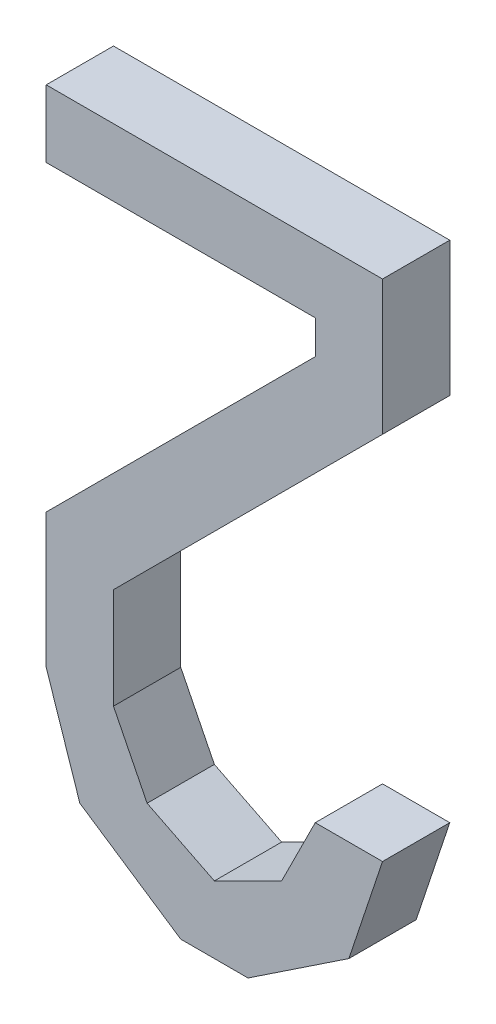
ISO-10303-21;
HEADER;
FILE_DESCRIPTION(('STEP AP214'),'2;1');
FILE_NAME('part.step','',(''),(''),'','','');
FILE_SCHEMA(('AUTOMOTIVE_DESIGN { 1 0 10303 214 1 1 1 1 }'));
ENDSEC;
DATA;
#1=APPLICATION_CONTEXT('core data for automotive mechanical design processes');
#2=APPLICATION_PROTOCOL_DEFINITION('international standard','automotive_design',2000,#1);
#3=PRODUCT_CONTEXT('',#1,'mechanical');
#4=PRODUCT('Part','Part','',(#3));
#5=PRODUCT_RELATED_PRODUCT_CATEGORY('part','',(#4));
#6=PRODUCT_DEFINITION_FORMATION('','',#4);
#7=PRODUCT_DEFINITION_CONTEXT('part definition',#1,'design');
#8=PRODUCT_DEFINITION('design','',#6,#7);
#9=PRODUCT_DEFINITION_SHAPE('','',#8);
#10=(LENGTH_UNIT() NAMED_UNIT(*) SI_UNIT(.MILLI.,.METRE.));
#11=(NAMED_UNIT(*) PLANE_ANGLE_UNIT() SI_UNIT($,.RADIAN.));
#12=(NAMED_UNIT(*) SI_UNIT($,.STERADIAN.) SOLID_ANGLE_UNIT());
#13=UNCERTAINTY_MEASURE_WITH_UNIT(LENGTH_MEASURE(1.E-05),#10,'distance_accuracy_value','');
#14=(GEOMETRIC_REPRESENTATION_CONTEXT(3) GLOBAL_UNCERTAINTY_ASSIGNED_CONTEXT((#13)) GLOBAL_UNIT_ASSIGNED_CONTEXT((#10,
#11,#12)) REPRESENTATION_CONTEXT('',''));
#15=CARTESIAN_POINT('',(0.,0.,0.));
#16=DIRECTION('',(0.,0.,1.));
#17=DIRECTION('',(1.,0.,0.));
#18=AXIS2_PLACEMENT_3D('',#15,#16,#17);
#19=CARTESIAN_POINT('',(0.0635,0.127,0.0254));
#20=DIRECTION('',(0.,0.,1.));
#21=DIRECTION('',(1.,0.,0.));
#22=AXIS2_PLACEMENT_3D('',#19,#20,#21);
#23=PLANE('',#22);
#24=DIRECTION('',(0.707106781186048,0.707106781187048,0.));
#25=VECTOR('',#24,1.);
#26=CARTESIAN_POINT('',(0.0635,0.0762,0.0254));
#27=LINE('',#26,#25);
#28=CARTESIAN_POINT('',(0.0635,0.0762,0.0254));
#29=VERTEX_POINT('',#28);
#30=CARTESIAN_POINT('',(-0.0380999999999845,-0.0254000000000354,0.0254));
#31=VERTEX_POINT('',#30);
#32=EDGE_CURVE('E227',#29,#31,#27,.F.);
#33=ORIENTED_EDGE('',*,*,#32,.F.);
#34=DIRECTION('',(0.,1.,0.));
#35=VECTOR('',#34,1.);
#36=CARTESIAN_POINT('',(0.0635,0.127,0.0254));
#37=LINE('',#36,#35);
#38=CARTESIAN_POINT('',(0.0635,0.127,0.0254));
#39=VERTEX_POINT('',#38);
#40=EDGE_CURVE('E160',#39,#29,#37,.F.);
#41=ORIENTED_EDGE('',*,*,#40,.F.);
#42=DIRECTION('',(1.,0.,0.));
#43=VECTOR('',#42,1.);
#44=CARTESIAN_POINT('',(-0.0635,0.127,0.0254));
#45=LINE('',#44,#43);
#46=CARTESIAN_POINT('',(-0.0635,0.127,0.0254));
#47=VERTEX_POINT('',#46);
#48=EDGE_CURVE('E20',#47,#39,#45,.T.);
#49=ORIENTED_EDGE('',*,*,#48,.F.);
#50=DIRECTION('',(0.,1.,0.));
#51=VECTOR('',#50,1.);
#52=CARTESIAN_POINT('',(-0.0635,0.1016,0.0254));
#53=LINE('',#52,#51);
#54=CARTESIAN_POINT('',(-0.0635,0.1016,0.0254));
#55=VERTEX_POINT('',#54);
#56=EDGE_CURVE('E149',#55,#47,#53,.T.);
#57=ORIENTED_EDGE('',*,*,#56,.F.);
#58=DIRECTION('',(1.,0.,0.));
#59=VECTOR('',#58,1.);
#60=CARTESIAN_POINT('',(0.0381,0.1016,0.0254));
#61=LINE('',#60,#59);
#62=CARTESIAN_POINT('',(0.0381,0.1016,0.0254));
#63=VERTEX_POINT('',#62);
#64=EDGE_CURVE('E144',#63,#55,#61,.F.);
#65=ORIENTED_EDGE('',*,*,#64,.F.);
#66=DIRECTION('',(0.,1.,0.));
#67=VECTOR('',#66,1.);
#68=CARTESIAN_POINT('',(0.0381,0.0889,0.0254));
#69=LINE('',#68,#67);
#70=CARTESIAN_POINT('',(0.0380999999999845,0.0889000000000155,0.0254));
#71=VERTEX_POINT('',#70);
#72=EDGE_CURVE('E171',#71,#63,#69,.T.);
#73=ORIENTED_EDGE('',*,*,#72,.F.);
#74=DIRECTION('',(-0.707106781186048,-0.707106781187048,0.));
#75=VECTOR('',#74,1.);
#76=CARTESIAN_POINT('',(-0.0635,-0.01270000000002,0.0254));
#77=LINE('',#76,#75);
#78=CARTESIAN_POINT('',(-0.0635,-0.01270000000002,0.0254));
#79=VERTEX_POINT('',#78);
#80=EDGE_CURVE('E175',#79,#71,#77,.F.);
#81=ORIENTED_EDGE('',*,*,#80,.F.);
#82=DIRECTION('',(0.,1.,0.));
#83=VECTOR('',#82,1.);
#84=CARTESIAN_POINT('',(-0.0635,-0.0635,0.0254));
#85=LINE('',#84,#83);
#86=CARTESIAN_POINT('',(-0.063500000000003,-0.0635000000000009,0.0254));
#87=VERTEX_POINT('',#86);
#88=EDGE_CURVE('E179',#87,#79,#85,.T.);
#89=ORIENTED_EDGE('',*,*,#88,.F.);
#90=DIRECTION('',(0.316227766017138,-0.948683298050414,0.));
#91=VECTOR('',#90,1.);
#92=CARTESIAN_POINT('',(-0.0508,-0.1016,0.0254));
#93=LINE('',#92,#91);
#94=CARTESIAN_POINT('',(-0.0508000000000018,-0.101600000000003,0.0254));
#95=VERTEX_POINT('',#94);
#96=EDGE_CURVE('E183',#95,#87,#93,.F.);
#97=ORIENTED_EDGE('',*,*,#96,.F.);
#98=DIRECTION('',(0.832050294337997,-0.554700196224998,0.));
#99=VECTOR('',#98,1.);
#100=CARTESIAN_POINT('',(-0.0127,-0.127,0.0254));
#101=LINE('',#100,#99);
#102=CARTESIAN_POINT('',(-0.0127,-0.127,0.0254));
#103=VERTEX_POINT('',#102);
#104=EDGE_CURVE('E187',#103,#95,#101,.F.);
#105=ORIENTED_EDGE('',*,*,#104,.F.);
#106=DIRECTION('',(1.,0.,0.));
#107=VECTOR('',#106,1.);
#108=CARTESIAN_POINT('',(0.0127,-0.127,0.0254));
#109=LINE('',#108,#107);
#110=CARTESIAN_POINT('',(0.0126999999999982,-0.126999999999997,0.0254));
#111=VERTEX_POINT('',#110);
#112=EDGE_CURVE('E191',#111,#103,#109,.F.);
#113=ORIENTED_EDGE('',*,*,#112,.F.);
#114=DIRECTION('',(0.832050294337997,0.554700196224998,0.));
#115=VECTOR('',#114,1.);
#116=CARTESIAN_POINT('',(0.0508,-0.1016,0.0254));
#117=LINE('',#116,#115);
#118=CARTESIAN_POINT('',(0.050799999999997,-0.101599999999999,0.0254));
#119=VERTEX_POINT('',#118);
#120=EDGE_CURVE('E195',#119,#111,#117,.F.);
#121=ORIENTED_EDGE('',*,*,#120,.F.);
#122=DIRECTION('',(0.316227766017138,0.948683298050414,0.));
#123=VECTOR('',#122,1.);
#124=CARTESIAN_POINT('',(0.0635,-0.0635,0.0254));
#125=LINE('',#124,#123);
#126=CARTESIAN_POINT('',(0.0635,-0.0635,0.0254));
#127=VERTEX_POINT('',#126);
#128=EDGE_CURVE('E199',#127,#119,#125,.F.);
#129=ORIENTED_EDGE('',*,*,#128,.F.);
#130=DIRECTION('',(1.,0.,0.));
#131=VECTOR('',#130,1.);
#132=CARTESIAN_POINT('',(0.0381,-0.0635,0.0254));
#133=LINE('',#132,#131);
#134=CARTESIAN_POINT('',(0.038100000000002,-0.063500000000001,0.0254));
#135=VERTEX_POINT('',#134);
#136=EDGE_CURVE('E203',#135,#127,#133,.T.);
#137=ORIENTED_EDGE('',*,*,#136,.F.);
#138=DIRECTION('',(-0.447213595499958,-0.894427190999916,0.));
#139=VECTOR('',#138,1.);
#140=CARTESIAN_POINT('',(0.0254,-0.08890000000002,0.0254));
#141=LINE('',#140,#139);
#142=CARTESIAN_POINT('',(0.025399999999998,-0.088900000000016,0.0254));
#143=VERTEX_POINT('',#142);
#144=EDGE_CURVE('E207',#143,#135,#141,.F.);
#145=ORIENTED_EDGE('',*,*,#144,.F.);
#146=DIRECTION('',(-0.894427190999916,-0.447213595499958,0.));
#147=VECTOR('',#146,1.);
#148=CARTESIAN_POINT('',(0.,-0.1016,0.0254));
#149=LINE('',#148,#147);
#150=CARTESIAN_POINT('',(0.,-0.101600000000004,0.0254));
#151=VERTEX_POINT('',#150);
#152=EDGE_CURVE('E211',#151,#143,#149,.F.);
#153=ORIENTED_EDGE('',*,*,#152,.F.);
#154=DIRECTION('',(-0.894427190999916,0.447213595499958,0.));
#155=VECTOR('',#154,1.);
#156=CARTESIAN_POINT('',(-0.0254,-0.08890000000002,0.0254));
#157=LINE('',#156,#155);
#158=CARTESIAN_POINT('',(-0.025399999999998,-0.088900000000019,0.0254));
#159=VERTEX_POINT('',#158);
#160=EDGE_CURVE('E215',#159,#151,#157,.F.);
#161=ORIENTED_EDGE('',*,*,#160,.F.);
#162=DIRECTION('',(-0.447213595499958,0.894427190999916,0.));
#163=VECTOR('',#162,1.);
#164=CARTESIAN_POINT('',(-0.0381,-0.0635,0.0254));
#165=LINE('',#164,#163);
#166=CARTESIAN_POINT('',(-0.0381,-0.0635,0.0254));
#167=VERTEX_POINT('',#166);
#168=EDGE_CURVE('E219',#167,#159,#165,.F.);
#169=ORIENTED_EDGE('',*,*,#168,.F.);
#170=DIRECTION('',(0.,1.,0.));
#171=VECTOR('',#170,1.);
#172=CARTESIAN_POINT('',(-0.0381,-0.02540000000002,0.0254));
#173=LINE('',#172,#171);
#174=EDGE_CURVE('E223',#31,#167,#173,.F.);
#175=ORIENTED_EDGE('',*,*,#174,.F.);
#176=EDGE_LOOP('',(#33,#41,#49,#57,#65,#73,#81,#89,#97,#105,#113,#121,#129,#137,#145,#153,#161,
#169,#175));
#177=FACE_BOUND('',#176,.T.);
#178=ADVANCED_FACE('F17',(#177),#23,.T.);
#179=CARTESIAN_POINT('',(-0.0635,0.127,0.));
#180=DIRECTION('',(0.,1.,0.));
#181=DIRECTION('',(0.,0.,1.));
#182=AXIS2_PLACEMENT_3D('',#179,#180,#181);
#183=PLANE('',#182);
#184=DIRECTION('',(0.,0.,-1.));
#185=VECTOR('',#184,1.);
#186=CARTESIAN_POINT('',(0.0635,0.127,0.));
#187=LINE('',#186,#185);
#188=CARTESIAN_POINT('',(0.0635,0.127,0.));
#189=VERTEX_POINT('',#188);
#190=EDGE_CURVE('E231',#189,#39,#187,.F.);
#191=ORIENTED_EDGE('',*,*,#190,.F.);
#192=DIRECTION('',(1.,0.,0.));
#193=VECTOR('',#192,1.);
#194=CARTESIAN_POINT('',(0.0635,0.127,0.));
#195=LINE('',#194,#193);
#196=CARTESIAN_POINT('',(-0.0635,0.127,0.));
#197=VERTEX_POINT('',#196);
#198=EDGE_CURVE('E166',#189,#197,#195,.F.);
#199=ORIENTED_EDGE('',*,*,#198,.T.);
#200=DIRECTION('',(0.,0.,1.));
#201=VECTOR('',#200,1.);
#202=CARTESIAN_POINT('',(-0.0635,0.127,0.));
#203=LINE('',#202,#201);
#204=EDGE_CURVE('E154',#47,#197,#203,.F.);
#205=ORIENTED_EDGE('',*,*,#204,.F.);
#206=ORIENTED_EDGE('',*,*,#48,.T.);
#207=EDGE_LOOP('',(#191,#199,#205,#206));
#208=FACE_BOUND('',#207,.T.);
#209=ADVANCED_FACE('F165',(#208),#183,.T.);
#210=CARTESIAN_POINT('',(-0.0635,0.1016,0.));
#211=DIRECTION('',(-1.,0.,0.));
#212=DIRECTION('',(0.,0.,1.));
#213=AXIS2_PLACEMENT_3D('',#210,#211,#212);
#214=PLANE('',#213);
#215=ORIENTED_EDGE('',*,*,#204,.T.);
#216=DIRECTION('',(0.,1.,0.));
#217=VECTOR('',#216,1.);
#218=CARTESIAN_POINT('',(-0.0635,0.127,0.));
#219=LINE('',#218,#217);
#220=CARTESIAN_POINT('',(-0.0635,0.1016,0.));
#221=VERTEX_POINT('',#220);
#222=EDGE_CURVE('E236',#197,#221,#219,.F.);
#223=ORIENTED_EDGE('',*,*,#222,.T.);
#224=DIRECTION('',(0.,0.,-1.));
#225=VECTOR('',#224,1.);
#226=CARTESIAN_POINT('',(-0.0635,0.1016,0.));
#227=LINE('',#226,#225);
#228=EDGE_CURVE('E156',#55,#221,#227,.T.);
#229=ORIENTED_EDGE('',*,*,#228,.F.);
#230=ORIENTED_EDGE('',*,*,#56,.T.);
#231=EDGE_LOOP('',(#215,#223,#229,#230));
#232=FACE_BOUND('',#231,.T.);
#233=ADVANCED_FACE('F151',(#232),#214,.T.);
#234=CARTESIAN_POINT('',(0.0381,0.1016,0.));
#235=DIRECTION('',(0.,-1.,0.));
#236=DIRECTION('',(0.,0.,-1.));
#237=AXIS2_PLACEMENT_3D('',#234,#235,#236);
#238=PLANE('',#237);
#239=ORIENTED_EDGE('',*,*,#228,.T.);
#240=DIRECTION('',(1.,0.,0.));
#241=VECTOR('',#240,1.);
#242=CARTESIAN_POINT('',(0.0635,0.1016,0.));
#243=LINE('',#242,#241);
#244=CARTESIAN_POINT('',(0.0381,0.1016,0.));
#245=VERTEX_POINT('',#244);
#246=EDGE_CURVE('E238',#221,#245,#243,.T.);
#247=ORIENTED_EDGE('',*,*,#246,.T.);
#248=DIRECTION('',(0.,0.,1.));
#249=VECTOR('',#248,1.);
#250=CARTESIAN_POINT('',(0.0381,0.1016,0.));
#251=LINE('',#250,#249);
#252=EDGE_CURVE('E173',#63,#245,#251,.F.);
#253=ORIENTED_EDGE('',*,*,#252,.F.);
#254=ORIENTED_EDGE('',*,*,#64,.T.);
#255=EDGE_LOOP('',(#239,#247,#253,#254));
#256=FACE_BOUND('',#255,.T.);
#257=ADVANCED_FACE('F360',(#256),#238,.T.);
#258=CARTESIAN_POINT('',(0.0381,0.0889,0.));
#259=DIRECTION('',(-1.,0.,0.));
#260=DIRECTION('',(0.,0.,1.));
#261=AXIS2_PLACEMENT_3D('',#258,#259,#260);
#262=PLANE('',#261);
#263=ORIENTED_EDGE('',*,*,#252,.T.);
#264=DIRECTION('',(0.,1.,0.));
#265=VECTOR('',#264,1.);
#266=CARTESIAN_POINT('',(0.0381,0.127,0.));
#267=LINE('',#266,#265);
#268=CARTESIAN_POINT('',(0.0380999999999845,0.0889000000000155,0.));
#269=VERTEX_POINT('',#268);
#270=EDGE_CURVE('E241',#245,#269,#267,.F.);
#271=ORIENTED_EDGE('',*,*,#270,.T.);
#272=DIRECTION('',(0.,0.,1.));
#273=VECTOR('',#272,1.);
#274=CARTESIAN_POINT('',(0.0380999999999381,0.0889000000000618,0.));
#275=LINE('',#274,#273);
#276=EDGE_CURVE('E177',#71,#269,#275,.F.);
#277=ORIENTED_EDGE('',*,*,#276,.F.);
#278=ORIENTED_EDGE('',*,*,#72,.T.);
#279=EDGE_LOOP('',(#263,#271,#277,#278));
#280=FACE_BOUND('',#279,.T.);
#281=ADVANCED_FACE('F358',(#280),#262,.T.);
#282=CARTESIAN_POINT('',(-0.0635,-0.01270000000002,0.));
#283=DIRECTION('',(-0.707106781187048,0.707106781186048,0.));
#284=DIRECTION('',(-0.707106781186048,-0.707106781187048,0.));
#285=AXIS2_PLACEMENT_3D('',#282,#283,#284);
#286=PLANE('',#285);
#287=ORIENTED_EDGE('',*,*,#276,.T.);
#288=DIRECTION('',(-0.707106781186478,-0.707106781186617,0.));
#289=VECTOR('',#288,1.);
#290=CARTESIAN_POINT('',(0.0381,0.0889,0.));
#291=LINE('',#290,#289);
#292=CARTESIAN_POINT('',(-0.0635,-0.01270000000002,0.));
#293=VERTEX_POINT('',#292);
#294=EDGE_CURVE('E244',#269,#293,#291,.T.);
#295=ORIENTED_EDGE('',*,*,#294,.T.);
#296=DIRECTION('',(0.,0.,1.));
#297=VECTOR('',#296,1.);
#298=CARTESIAN_POINT('',(-0.0635,-0.01270000000002,0.));
#299=LINE('',#298,#297);
#300=EDGE_CURVE('E181',#79,#293,#299,.F.);
#301=ORIENTED_EDGE('',*,*,#300,.F.);
#302=ORIENTED_EDGE('',*,*,#80,.T.);
#303=EDGE_LOOP('',(#287,#295,#301,#302));
#304=FACE_BOUND('',#303,.T.);
#305=ADVANCED_FACE('F354',(#304),#286,.T.);
#306=CARTESIAN_POINT('',(-0.0635,-0.0635,0.));
#307=DIRECTION('',(-1.,0.,0.));
#308=DIRECTION('',(0.,0.,1.));
#309=AXIS2_PLACEMENT_3D('',#306,#307,#308);
#310=PLANE('',#309);
#311=ORIENTED_EDGE('',*,*,#300,.T.);
#312=DIRECTION('',(0.,1.,0.));
#313=VECTOR('',#312,1.);
#314=CARTESIAN_POINT('',(-0.0635,0.127,0.));
#315=LINE('',#314,#313);
#316=CARTESIAN_POINT('',(-0.063500000000003,-0.063500000000001,0.));
#317=VERTEX_POINT('',#316);
#318=EDGE_CURVE('E247',#293,#317,#315,.F.);
#319=ORIENTED_EDGE('',*,*,#318,.T.);
#320=DIRECTION('',(0.,0.,1.));
#321=VECTOR('',#320,1.);
#322=CARTESIAN_POINT('',(-0.0635000000000121,-0.063500000000004,0.));
#323=LINE('',#322,#321);
#324=EDGE_CURVE('E185',#87,#317,#323,.F.);
#325=ORIENTED_EDGE('',*,*,#324,.F.);
#326=ORIENTED_EDGE('',*,*,#88,.T.);
#327=EDGE_LOOP('',(#311,#319,#325,#326));
#328=FACE_BOUND('',#327,.T.);
#329=ADVANCED_FACE('F348',(#328),#310,.T.);
#330=CARTESIAN_POINT('',(-0.0508,-0.1016,0.));
#331=DIRECTION('',(-0.948683298050414,-0.316227766017138,0.));
#332=DIRECTION('',(0.316227766017138,-0.948683298050414,0.));
#333=AXIS2_PLACEMENT_3D('',#330,#331,#332);
#334=PLANE('',#333);
#335=ORIENTED_EDGE('',*,*,#324,.T.);
#336=DIRECTION('',(0.316227766016838,-0.948683298050514,0.));
#337=VECTOR('',#336,1.);
#338=CARTESIAN_POINT('',(-0.0635,-0.0635,0.));
#339=LINE('',#338,#337);
#340=CARTESIAN_POINT('',(-0.0508000000000018,-0.101600000000003,0.));
#341=VERTEX_POINT('',#340);
#342=EDGE_CURVE('E250',#317,#341,#339,.T.);
#343=ORIENTED_EDGE('',*,*,#342,.T.);
#344=DIRECTION('',(0.,0.,1.));
#345=VECTOR('',#344,1.);
#346=CARTESIAN_POINT('',(-0.050800000000007,-0.101600000000011,0.));
#347=LINE('',#346,#345);
#348=EDGE_CURVE('E189',#95,#341,#347,.F.);
#349=ORIENTED_EDGE('',*,*,#348,.F.);
#350=ORIENTED_EDGE('',*,*,#96,.T.);
#351=EDGE_LOOP('',(#335,#343,#349,#350));
#352=FACE_BOUND('',#351,.T.);
#353=ADVANCED_FACE('F344',(#352),#334,.T.);
#354=CARTESIAN_POINT('',(-0.0127,-0.127,0.));
#355=DIRECTION('',(-0.554700196224998,-0.832050294337997,0.));
#356=DIRECTION('',(0.832050294337997,-0.554700196224998,0.));
#357=AXIS2_PLACEMENT_3D('',#354,#355,#356);
#358=PLANE('',#357);
#359=ORIENTED_EDGE('',*,*,#348,.T.);
#360=DIRECTION('',(0.832050294337844,-0.554700196225229,0.));
#361=VECTOR('',#360,1.);
#362=CARTESIAN_POINT('',(-0.0508,-0.1016,0.));
#363=LINE('',#362,#361);
#364=CARTESIAN_POINT('',(-0.0127,-0.127,0.));
#365=VERTEX_POINT('',#364);
#366=EDGE_CURVE('E253',#341,#365,#363,.T.);
#367=ORIENTED_EDGE('',*,*,#366,.T.);
#368=DIRECTION('',(0.,0.,-1.));
#369=VECTOR('',#368,1.);
#370=CARTESIAN_POINT('',(-0.0127,-0.127,0.));
#371=LINE('',#370,#369);
#372=EDGE_CURVE('E193',#103,#365,#371,.T.);
#373=ORIENTED_EDGE('',*,*,#372,.F.);
#374=ORIENTED_EDGE('',*,*,#104,.T.);
#375=EDGE_LOOP('',(#359,#367,#373,#374));
#376=FACE_BOUND('',#375,.T.);
#377=ADVANCED_FACE('F338',(#376),#358,.T.);
#378=CARTESIAN_POINT('',(0.0127,-0.127,0.));
#379=DIRECTION('',(0.,-1.,0.));
#380=DIRECTION('',(0.,0.,-1.));
#381=AXIS2_PLACEMENT_3D('',#378,#379,#380);
#382=PLANE('',#381);
#383=ORIENTED_EDGE('',*,*,#372,.T.);
#384=DIRECTION('',(1.,0.,0.));
#385=VECTOR('',#384,1.);
#386=CARTESIAN_POINT('',(0.0635,-0.127,0.));
#387=LINE('',#386,#385);
#388=CARTESIAN_POINT('',(0.0126999999999982,-0.126999999999997,0.));
#389=VERTEX_POINT('',#388);
#390=EDGE_CURVE('E256',#365,#389,#387,.T.);
#391=ORIENTED_EDGE('',*,*,#390,.T.);
#392=DIRECTION('',(0.,0.,1.));
#393=VECTOR('',#392,1.);
#394=CARTESIAN_POINT('',(0.012699999999993,-0.126999999999989,0.));
#395=LINE('',#394,#393);
#396=EDGE_CURVE('E197',#111,#389,#395,.F.);
#397=ORIENTED_EDGE('',*,*,#396,.F.);
#398=ORIENTED_EDGE('',*,*,#112,.T.);
#399=EDGE_LOOP('',(#383,#391,#397,#398));
#400=FACE_BOUND('',#399,.T.);
#401=ADVANCED_FACE('F334',(#400),#382,.T.);
#402=CARTESIAN_POINT('',(0.0508,-0.1016,0.));
#403=DIRECTION('',(0.554700196224998,-0.832050294337997,0.));
#404=DIRECTION('',(0.832050294337997,0.554700196224998,0.));
#405=AXIS2_PLACEMENT_3D('',#402,#403,#404);
#406=PLANE('',#405);
#407=ORIENTED_EDGE('',*,*,#396,.T.);
#408=DIRECTION('',(0.832050294337844,0.554700196225229,0.));
#409=VECTOR('',#408,1.);
#410=CARTESIAN_POINT('',(0.0127,-0.127,0.));
#411=LINE('',#410,#409);
#412=CARTESIAN_POINT('',(0.050799999999997,-0.101599999999999,0.));
#413=VERTEX_POINT('',#412);
#414=EDGE_CURVE('E259',#389,#413,#411,.T.);
#415=ORIENTED_EDGE('',*,*,#414,.T.);
#416=DIRECTION('',(0.,0.,1.));
#417=VECTOR('',#416,1.);
#418=CARTESIAN_POINT('',(0.0507999999999879,-0.101599999999996,0.));
#419=LINE('',#418,#417);
#420=EDGE_CURVE('E201',#119,#413,#419,.F.);
#421=ORIENTED_EDGE('',*,*,#420,.F.);
#422=ORIENTED_EDGE('',*,*,#120,.T.);
#423=EDGE_LOOP('',(#407,#415,#421,#422));
#424=FACE_BOUND('',#423,.T.);
#425=ADVANCED_FACE('F328',(#424),#406,.T.);
#426=CARTESIAN_POINT('',(0.0635,-0.0635,0.));
#427=DIRECTION('',(0.948683298050414,-0.316227766017138,0.));
#428=DIRECTION('',(0.316227766017138,0.948683298050414,0.));
#429=AXIS2_PLACEMENT_3D('',#426,#427,#428);
#430=PLANE('',#429);
#431=ORIENTED_EDGE('',*,*,#420,.T.);
#432=DIRECTION('',(0.316227766016838,0.948683298050514,0.));
#433=VECTOR('',#432,1.);
#434=CARTESIAN_POINT('',(0.0508,-0.1016,0.));
#435=LINE('',#434,#433);
#436=CARTESIAN_POINT('',(0.0635,-0.0635,0.));
#437=VERTEX_POINT('',#436);
#438=EDGE_CURVE('E262',#413,#437,#435,.T.);
#439=ORIENTED_EDGE('',*,*,#438,.T.);
#440=DIRECTION('',(0.,0.,1.));
#441=VECTOR('',#440,1.);
#442=CARTESIAN_POINT('',(0.0635,-0.0635,0.));
#443=LINE('',#442,#441);
#444=EDGE_CURVE('E205',#127,#437,#443,.F.);
#445=ORIENTED_EDGE('',*,*,#444,.F.);
#446=ORIENTED_EDGE('',*,*,#128,.T.);
#447=EDGE_LOOP('',(#431,#439,#445,#446));
#448=FACE_BOUND('',#447,.T.);
#449=ADVANCED_FACE('F324',(#448),#430,.T.);
#450=CARTESIAN_POINT('',(0.0381,-0.0635,0.));
#451=DIRECTION('',(0.,1.,0.));
#452=DIRECTION('',(0.,0.,1.));
#453=AXIS2_PLACEMENT_3D('',#450,#451,#452);
#454=PLANE('',#453);
#455=ORIENTED_EDGE('',*,*,#444,.T.);
#456=DIRECTION('',(1.,0.,0.));
#457=VECTOR('',#456,1.);
#458=CARTESIAN_POINT('',(0.0635,-0.0635,0.));
#459=LINE('',#458,#457);
#460=CARTESIAN_POINT('',(0.038100000000002,-0.063500000000001,0.));
#461=VERTEX_POINT('',#460);
#462=EDGE_CURVE('E265',#437,#461,#459,.F.);
#463=ORIENTED_EDGE('',*,*,#462,.T.);
#464=DIRECTION('',(0.,0.,1.));
#465=VECTOR('',#464,1.);
#466=CARTESIAN_POINT('',(0.038100000000008,-0.063500000000004,0.));
#467=LINE('',#466,#465);
#468=EDGE_CURVE('E209',#135,#461,#467,.F.);
#469=ORIENTED_EDGE('',*,*,#468,.F.);
#470=ORIENTED_EDGE('',*,*,#136,.T.);
#471=EDGE_LOOP('',(#455,#463,#469,#470));
#472=FACE_BOUND('',#471,.T.);
#473=ADVANCED_FACE('F318',(#472),#454,.T.);
#474=CARTESIAN_POINT('',(0.0254,-0.08890000000002,0.));
#475=DIRECTION('',(-0.894427190999916,0.447213595499958,0.));
#476=DIRECTION('',(-0.447213595499958,-0.894427190999916,0.));
#477=AXIS2_PLACEMENT_3D('',#474,#475,#476);
#478=PLANE('',#477);
#479=ORIENTED_EDGE('',*,*,#468,.T.);
#480=DIRECTION('',(-0.447213595499676,-0.894427191000057,0.));
#481=VECTOR('',#480,1.);
#482=CARTESIAN_POINT('',(0.0381,-0.0635,0.));
#483=LINE('',#482,#481);
#484=CARTESIAN_POINT('',(0.025399999999998,-0.088900000000016,0.));
#485=VERTEX_POINT('',#484);
#486=EDGE_CURVE('E268',#461,#485,#483,.T.);
#487=ORIENTED_EDGE('',*,*,#486,.T.);
#488=DIRECTION('',(0.,0.,1.));
#489=VECTOR('',#488,1.);
#490=CARTESIAN_POINT('',(0.025399999999992,-0.088900000000004,0.));
#491=LINE('',#490,#489);
#492=EDGE_CURVE('E213',#143,#485,#491,.F.);
#493=ORIENTED_EDGE('',*,*,#492,.F.);
#494=ORIENTED_EDGE('',*,*,#144,.T.);
#495=EDGE_LOOP('',(#479,#487,#493,#494));
#496=FACE_BOUND('',#495,.T.);
#497=ADVANCED_FACE('F314',(#496),#478,.T.);
#498=CARTESIAN_POINT('',(0.,-0.1016,0.));
#499=DIRECTION('',(-0.447213595499958,0.894427190999916,0.));
#500=DIRECTION('',(-0.894427190999916,-0.447213595499958,0.));
#501=AXIS2_PLACEMENT_3D('',#498,#499,#500);
#502=PLANE('',#501);
#503=ORIENTED_EDGE('',*,*,#492,.T.);
#504=DIRECTION('',(-0.894427191000197,-0.447213595499395,0.));
#505=VECTOR('',#504,1.);
#506=CARTESIAN_POINT('',(0.0254,-0.08890000000002,0.));
#507=LINE('',#506,#505);
#508=CARTESIAN_POINT('',(0.,-0.101600000000004,0.));
#509=VERTEX_POINT('',#508);
#510=EDGE_CURVE('E271',#485,#509,#507,.T.);
#511=ORIENTED_EDGE('',*,*,#510,.T.);
#512=DIRECTION('',(0.,0.,1.));
#513=VECTOR('',#512,1.);
#514=CARTESIAN_POINT('',(0.,-0.101600000000016,0.));
#515=LINE('',#514,#513);
#516=EDGE_CURVE('E217',#151,#509,#515,.F.);
#517=ORIENTED_EDGE('',*,*,#516,.F.);
#518=ORIENTED_EDGE('',*,*,#152,.T.);
#519=EDGE_LOOP('',(#503,#511,#517,#518));
#520=FACE_BOUND('',#519,.T.);
#521=ADVANCED_FACE('F308',(#520),#502,.T.);
#522=CARTESIAN_POINT('',(-0.0254,-0.08890000000002,0.));
#523=DIRECTION('',(0.447213595499958,0.894427190999916,0.));
#524=DIRECTION('',(-0.894427190999916,0.447213595499958,0.));
#525=AXIS2_PLACEMENT_3D('',#522,#523,#524);
#526=PLANE('',#525);
#527=ORIENTED_EDGE('',*,*,#516,.T.);
#528=DIRECTION('',(-0.894427191000198,0.447213595499395,0.));
#529=VECTOR('',#528,1.);
#530=CARTESIAN_POINT('',(0.,-0.1016,0.));
#531=LINE('',#530,#529);
#532=CARTESIAN_POINT('',(-0.025399999999998,-0.088900000000019,0.));
#533=VERTEX_POINT('',#532);
#534=EDGE_CURVE('E274',#509,#533,#531,.T.);
#535=ORIENTED_EDGE('',*,*,#534,.T.);
#536=DIRECTION('',(0.,0.,1.));
#537=VECTOR('',#536,1.);
#538=CARTESIAN_POINT('',(-0.025399999999992,-0.088900000000016,0.));
#539=LINE('',#538,#537);
#540=EDGE_CURVE('E221',#159,#533,#539,.F.);
#541=ORIENTED_EDGE('',*,*,#540,.F.);
#542=ORIENTED_EDGE('',*,*,#160,.T.);
#543=EDGE_LOOP('',(#527,#535,#541,#542));
#544=FACE_BOUND('',#543,.T.);
#545=ADVANCED_FACE('F304',(#544),#526,.T.);
#546=CARTESIAN_POINT('',(-0.0381,-0.0635,0.));
#547=DIRECTION('',(0.894427190999916,0.447213595499958,0.));
#548=DIRECTION('',(-0.447213595499958,0.894427190999916,0.));
#549=AXIS2_PLACEMENT_3D('',#546,#547,#548);
#550=PLANE('',#549);
#551=ORIENTED_EDGE('',*,*,#540,.T.);
#552=DIRECTION('',(-0.447213595499677,0.894427191000057,0.));
#553=VECTOR('',#552,1.);
#554=CARTESIAN_POINT('',(-0.0254,-0.08890000000002,0.));
#555=LINE('',#554,#553);
#556=CARTESIAN_POINT('',(-0.0381,-0.0635,0.));
#557=VERTEX_POINT('',#556);
#558=EDGE_CURVE('E277',#533,#557,#555,.T.);
#559=ORIENTED_EDGE('',*,*,#558,.T.);
#560=DIRECTION('',(0.,0.,-1.));
#561=VECTOR('',#560,1.);
#562=CARTESIAN_POINT('',(-0.0381,-0.0635,0.));
#563=LINE('',#562,#561);
#564=EDGE_CURVE('E225',#167,#557,#563,.T.);
#565=ORIENTED_EDGE('',*,*,#564,.F.);
#566=ORIENTED_EDGE('',*,*,#168,.T.);
#567=EDGE_LOOP('',(#551,#559,#565,#566));
#568=FACE_BOUND('',#567,.T.);
#569=ADVANCED_FACE('F298',(#568),#550,.T.);
#570=CARTESIAN_POINT('',(-0.0381,-0.02540000000002,0.));
#571=DIRECTION('',(1.,0.,0.));
#572=DIRECTION('',(0.,0.,-1.));
#573=AXIS2_PLACEMENT_3D('',#570,#571,#572);
#574=PLANE('',#573);
#575=ORIENTED_EDGE('',*,*,#564,.T.);
#576=DIRECTION('',(0.,1.,0.));
#577=VECTOR('',#576,1.);
#578=CARTESIAN_POINT('',(-0.0381,0.127,0.));
#579=LINE('',#578,#577);
#580=CARTESIAN_POINT('',(-0.0380999999999845,-0.0254000000000354,0.));
#581=VERTEX_POINT('',#580);
#582=EDGE_CURVE('E280',#557,#581,#579,.T.);
#583=ORIENTED_EDGE('',*,*,#582,.T.);
#584=DIRECTION('',(0.,0.,1.));
#585=VECTOR('',#584,1.);
#586=CARTESIAN_POINT('',(-0.0380999999999381,-0.0254000000000818,0.));
#587=LINE('',#586,#585);
#588=EDGE_CURVE('E229',#31,#581,#587,.F.);
#589=ORIENTED_EDGE('',*,*,#588,.F.);
#590=ORIENTED_EDGE('',*,*,#174,.T.);
#591=EDGE_LOOP('',(#575,#583,#589,#590));
#592=FACE_BOUND('',#591,.T.);
#593=ADVANCED_FACE('F293',(#592),#574,.T.);
#594=CARTESIAN_POINT('',(0.0635,0.0762,0.));
#595=DIRECTION('',(0.707106781187048,-0.707106781186048,0.));
#596=DIRECTION('',(0.707106781186048,0.707106781187048,0.));
#597=AXIS2_PLACEMENT_3D('',#594,#595,#596);
#598=PLANE('',#597);
#599=ORIENTED_EDGE('',*,*,#588,.T.);
#600=DIRECTION('',(0.707106781186478,0.707106781186617,0.));
#601=VECTOR('',#600,1.);
#602=CARTESIAN_POINT('',(-0.0381,-0.02540000000002,0.));
#603=LINE('',#602,#601);
#604=CARTESIAN_POINT('',(0.0635,0.0762,0.));
#605=VERTEX_POINT('',#604);
#606=EDGE_CURVE('E26',#581,#605,#603,.T.);
#607=ORIENTED_EDGE('',*,*,#606,.T.);
#608=DIRECTION('',(0.,0.,-1.));
#609=VECTOR('',#608,1.);
#610=CARTESIAN_POINT('',(0.0635,0.0762,0.));
#611=LINE('',#610,#609);
#612=EDGE_CURVE('E34',#29,#605,#611,.T.);
#613=ORIENTED_EDGE('',*,*,#612,.F.);
#614=ORIENTED_EDGE('',*,*,#32,.T.);
#615=EDGE_LOOP('',(#599,#607,#613,#614));
#616=FACE_BOUND('',#615,.T.);
#617=ADVANCED_FACE('F286',(#616),#598,.T.);
#618=CARTESIAN_POINT('',(0.0635,0.127,0.));
#619=DIRECTION('',(1.,0.,0.));
#620=DIRECTION('',(0.,0.,-1.));
#621=AXIS2_PLACEMENT_3D('',#618,#619,#620);
#622=PLANE('',#621);
#623=ORIENTED_EDGE('',*,*,#612,.T.);
#624=DIRECTION('',(0.,1.,0.));
#625=VECTOR('',#624,1.);
#626=CARTESIAN_POINT('',(0.0635,0.127,0.));
#627=LINE('',#626,#625);
#628=EDGE_CURVE('E11',#605,#189,#627,.T.);
#629=ORIENTED_EDGE('',*,*,#628,.T.);
#630=ORIENTED_EDGE('',*,*,#190,.T.);
#631=ORIENTED_EDGE('',*,*,#40,.T.);
#632=EDGE_LOOP('',(#623,#629,#630,#631));
#633=FACE_BOUND('',#632,.T.);
#634=ADVANCED_FACE('F371',(#633),#622,.T.);
#635=CARTESIAN_POINT('',(0.0635,0.127,0.));
#636=DIRECTION('',(0.,0.,1.));
#637=DIRECTION('',(1.,0.,0.));
#638=AXIS2_PLACEMENT_3D('',#635,#636,#637);
#639=PLANE('',#638);
#640=ORIENTED_EDGE('',*,*,#606,.F.);
#641=ORIENTED_EDGE('',*,*,#582,.F.);
#642=ORIENTED_EDGE('',*,*,#558,.F.);
#643=ORIENTED_EDGE('',*,*,#534,.F.);
#644=ORIENTED_EDGE('',*,*,#510,.F.);
#645=ORIENTED_EDGE('',*,*,#486,.F.);
#646=ORIENTED_EDGE('',*,*,#462,.F.);
#647=ORIENTED_EDGE('',*,*,#438,.F.);
#648=ORIENTED_EDGE('',*,*,#414,.F.);
#649=ORIENTED_EDGE('',*,*,#390,.F.);
#650=ORIENTED_EDGE('',*,*,#366,.F.);
#651=ORIENTED_EDGE('',*,*,#342,.F.);
#652=ORIENTED_EDGE('',*,*,#318,.F.);
#653=ORIENTED_EDGE('',*,*,#294,.F.);
#654=ORIENTED_EDGE('',*,*,#270,.F.);
#655=ORIENTED_EDGE('',*,*,#246,.F.);
#656=ORIENTED_EDGE('',*,*,#222,.F.);
#657=ORIENTED_EDGE('',*,*,#198,.F.);
#658=ORIENTED_EDGE('',*,*,#628,.F.);
#659=EDGE_LOOP('',(#640,#641,#642,#643,#644,#645,#646,#647,#648,#649,#650,#651,#652,#653,#654,
#655,#656,#657,#658));
#660=FACE_BOUND('',#659,.T.);
#661=ADVANCED_FACE('F290',(#660),#639,.F.);
#662=CLOSED_SHELL('',(#178,#209,#233,#257,#281,#305,#329,#353,#377,#401,#425,#449,#473,#497,
#521,#545,#569,#593,#617,#634,#661));
#663=MANIFOLD_SOLID_BREP('B1',#662);
#664=ADVANCED_BREP_SHAPE_REPRESENTATION('',(#18,#663),#14);
#665=SHAPE_DEFINITION_REPRESENTATION(#9,#664);
ENDSEC;
END-ISO-10303-21;
